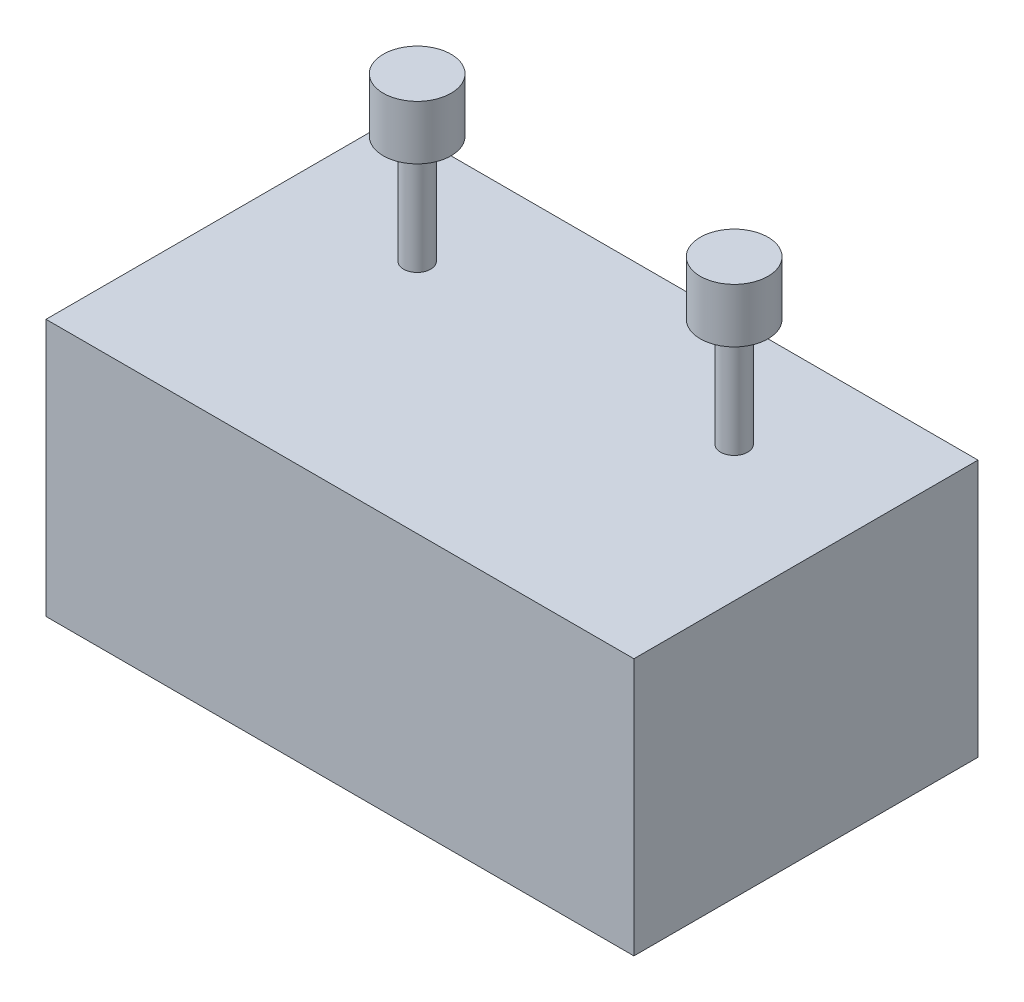
ISO-10303-21;
HEADER;
FILE_DESCRIPTION(('STEP AP214'),'2;1');
FILE_NAME('part.step','',(''),(''),'','','');
FILE_SCHEMA(('AUTOMOTIVE_DESIGN { 1 0 10303 214 1 1 1 1 }'));
ENDSEC;
DATA;
#1=APPLICATION_CONTEXT('core data for automotive mechanical design processes');
#2=APPLICATION_PROTOCOL_DEFINITION('international standard','automotive_design',2000,#1);
#3=PRODUCT_CONTEXT('',#1,'mechanical');
#4=PRODUCT('Part','Part','',(#3));
#5=PRODUCT_RELATED_PRODUCT_CATEGORY('part','',(#4));
#6=PRODUCT_DEFINITION_FORMATION('','',#4);
#7=PRODUCT_DEFINITION_CONTEXT('part definition',#1,'design');
#8=PRODUCT_DEFINITION('design','',#6,#7);
#9=PRODUCT_DEFINITION_SHAPE('','',#8);
#10=(LENGTH_UNIT() NAMED_UNIT(*) SI_UNIT(.MILLI.,.METRE.));
#11=(NAMED_UNIT(*) PLANE_ANGLE_UNIT() SI_UNIT($,.RADIAN.));
#12=(NAMED_UNIT(*) SI_UNIT($,.STERADIAN.) SOLID_ANGLE_UNIT());
#13=UNCERTAINTY_MEASURE_WITH_UNIT(LENGTH_MEASURE(1.E-05),#10,'distance_accuracy_value','');
#14=(GEOMETRIC_REPRESENTATION_CONTEXT(3) GLOBAL_UNCERTAINTY_ASSIGNED_CONTEXT((#13)) GLOBAL_UNIT_ASSIGNED_CONTEXT((#10,
#11,#12)) REPRESENTATION_CONTEXT('',''));
#15=CARTESIAN_POINT('',(0.,0.,0.));
#16=DIRECTION('',(0.,0.,1.));
#17=DIRECTION('',(1.,0.,0.));
#18=AXIS2_PLACEMENT_3D('',#15,#16,#17);
#19=CARTESIAN_POINT('',(108.5,95.,63.5));
#20=DIRECTION('',(-1.,0.,0.));
#21=DIRECTION('',(0.,0.,1.));
#22=AXIS2_PLACEMENT_3D('',#19,#20,#21);
#23=PLANE('',#22);
#24=DIRECTION('',(0.,0.,-1.));
#25=VECTOR('',#24,1.);
#26=CARTESIAN_POINT('',(108.5,0.,63.5));
#27=LINE('',#26,#25);
#28=CARTESIAN_POINT('',(108.5,0.,63.5));
#29=VERTEX_POINT('',#28);
#30=CARTESIAN_POINT('',(108.5,0.,-63.5));
#31=VERTEX_POINT('',#30);
#32=EDGE_CURVE('E111',#29,#31,#27,.T.);
#33=ORIENTED_EDGE('',*,*,#32,.T.);
#34=DIRECTION('',(0.,-1.,0.));
#35=VECTOR('',#34,1.);
#36=CARTESIAN_POINT('',(108.5,95.,-63.5));
#37=LINE('',#36,#35);
#38=CARTESIAN_POINT('',(108.5,95.,-63.5));
#39=VERTEX_POINT('',#38);
#40=EDGE_CURVE('E99',#39,#31,#37,.T.);
#41=ORIENTED_EDGE('',*,*,#40,.F.);
#42=DIRECTION('',(0.,0.,-1.));
#43=VECTOR('',#42,1.);
#44=CARTESIAN_POINT('',(108.5,95.,63.5));
#45=LINE('',#44,#43);
#46=CARTESIAN_POINT('',(108.5,95.,63.5));
#47=VERTEX_POINT('',#46);
#48=EDGE_CURVE('E91',#47,#39,#45,.T.);
#49=ORIENTED_EDGE('',*,*,#48,.F.);
#50=DIRECTION('',(0.,-1.,0.));
#51=VECTOR('',#50,1.);
#52=CARTESIAN_POINT('',(108.5,95.,63.5));
#53=LINE('',#52,#51);
#54=EDGE_CURVE('E107',#47,#29,#53,.T.);
#55=ORIENTED_EDGE('',*,*,#54,.T.);
#56=EDGE_LOOP('',(#33,#41,#49,#55));
#57=FACE_BOUND('',#56,.T.);
#58=ADVANCED_FACE('F38',(#57),#23,.F.);
#59=CARTESIAN_POINT('',(-108.5,95.,-63.5));
#60=DIRECTION('',(0.,0.,1.));
#61=DIRECTION('',(1.,0.,0.));
#62=AXIS2_PLACEMENT_3D('',#59,#60,#61);
#63=PLANE('',#62);
#64=DIRECTION('',(-1.,0.,0.));
#65=VECTOR('',#64,1.);
#66=CARTESIAN_POINT('',(-108.5,0.,-63.5));
#67=LINE('',#66,#65);
#68=CARTESIAN_POINT('',(-108.5,0.,-63.5));
#69=VERTEX_POINT('',#68);
#70=EDGE_CURVE('E97',#31,#69,#67,.T.);
#71=ORIENTED_EDGE('',*,*,#70,.T.);
#72=DIRECTION('',(0.,-1.,0.));
#73=VECTOR('',#72,1.);
#74=CARTESIAN_POINT('',(-108.5,95.,-63.5));
#75=LINE('',#74,#73);
#76=CARTESIAN_POINT('',(-108.5,95.,-63.5));
#77=VERTEX_POINT('',#76);
#78=EDGE_CURVE('E95',#77,#69,#75,.T.);
#79=ORIENTED_EDGE('',*,*,#78,.F.);
#80=DIRECTION('',(-1.,0.,0.));
#81=VECTOR('',#80,1.);
#82=CARTESIAN_POINT('',(-108.5,95.,-63.5));
#83=LINE('',#82,#81);
#84=EDGE_CURVE('E86',#39,#77,#83,.T.);
#85=ORIENTED_EDGE('',*,*,#84,.F.);
#86=ORIENTED_EDGE('',*,*,#40,.T.);
#87=EDGE_LOOP('',(#71,#79,#85,#86));
#88=FACE_BOUND('',#87,.T.);
#89=ADVANCED_FACE('F96',(#88),#63,.F.);
#90=CARTESIAN_POINT('',(-108.5,95.,63.5));
#91=DIRECTION('',(1.,0.,0.));
#92=DIRECTION('',(0.,0.,-1.));
#93=AXIS2_PLACEMENT_3D('',#90,#91,#92);
#94=PLANE('',#93);
#95=DIRECTION('',(0.,0.,1.));
#96=VECTOR('',#95,1.);
#97=CARTESIAN_POINT('',(-108.5,0.,63.5));
#98=LINE('',#97,#96);
#99=CARTESIAN_POINT('',(-108.5,0.,63.5));
#100=VERTEX_POINT('',#99);
#101=EDGE_CURVE('E72',#69,#100,#98,.T.);
#102=ORIENTED_EDGE('',*,*,#101,.T.);
#103=DIRECTION('',(0.,-1.,0.));
#104=VECTOR('',#103,1.);
#105=CARTESIAN_POINT('',(-108.5,95.,63.5));
#106=LINE('',#105,#104);
#107=CARTESIAN_POINT('',(-108.5,95.,63.5));
#108=VERTEX_POINT('',#107);
#109=EDGE_CURVE('E100',#108,#100,#106,.T.);
#110=ORIENTED_EDGE('',*,*,#109,.F.);
#111=DIRECTION('',(0.,0.,1.));
#112=VECTOR('',#111,1.);
#113=CARTESIAN_POINT('',(-108.5,95.,63.5));
#114=LINE('',#113,#112);
#115=EDGE_CURVE('E89',#77,#108,#114,.T.);
#116=ORIENTED_EDGE('',*,*,#115,.F.);
#117=ORIENTED_EDGE('',*,*,#78,.T.);
#118=EDGE_LOOP('',(#102,#110,#116,#117));
#119=FACE_BOUND('',#118,.T.);
#120=ADVANCED_FACE('F102',(#119),#94,.F.);
#121=CARTESIAN_POINT('',(-108.5,95.,63.5));
#122=DIRECTION('',(0.,0.,-1.));
#123=DIRECTION('',(-1.,0.,0.));
#124=AXIS2_PLACEMENT_3D('',#121,#122,#123);
#125=PLANE('',#124);
#126=DIRECTION('',(1.,0.,0.));
#127=VECTOR('',#126,1.);
#128=CARTESIAN_POINT('',(-108.5,0.,63.5));
#129=LINE('',#128,#127);
#130=EDGE_CURVE('E78',#100,#29,#129,.T.);
#131=ORIENTED_EDGE('',*,*,#130,.T.);
#132=ORIENTED_EDGE('',*,*,#54,.F.);
#133=DIRECTION('',(1.,0.,0.));
#134=VECTOR('',#133,1.);
#135=CARTESIAN_POINT('',(-108.5,95.,63.5));
#136=LINE('',#135,#134);
#137=EDGE_CURVE('E55',#108,#47,#136,.T.);
#138=ORIENTED_EDGE('',*,*,#137,.F.);
#139=ORIENTED_EDGE('',*,*,#109,.T.);
#140=EDGE_LOOP('',(#131,#132,#138,#139));
#141=FACE_BOUND('',#140,.T.);
#142=ADVANCED_FACE('F136',(#141),#125,.F.);
#143=CARTESIAN_POINT('',(0.,95.,0.));
#144=DIRECTION('',(0.,-1.,0.));
#145=DIRECTION('',(0.,0.,-1.));
#146=AXIS2_PLACEMENT_3D('',#143,#144,#145);
#147=PLANE('',#146);
#148=CARTESIAN_POINT('',(58.5,95.,-23.5));
#149=DIRECTION('',(0.,-1.,0.));
#150=DIRECTION('',(0.,0.,-1.));
#151=AXIS2_PLACEMENT_3D('',#148,#149,#150);
#152=CIRCLE('',#151,4.99999999999999);
#153=CARTESIAN_POINT('',(58.5,95.,-28.5));
#154=VERTEX_POINT('',#153);
#155=EDGE_CURVE('E11',#154,#154,#152,.F.);
#156=ORIENTED_EDGE('',*,*,#155,.F.);
#157=EDGE_LOOP('',(#156));
#158=FACE_BOUND('',#157,.T.);
#159=CARTESIAN_POINT('',(-58.5,95.,-23.5));
#160=DIRECTION('',(0.,-1.,0.));
#161=DIRECTION('',(0.,0.,-1.));
#162=AXIS2_PLACEMENT_3D('',#159,#160,#161);
#163=CIRCLE('',#162,5.);
#164=CARTESIAN_POINT('',(-58.5,95.,-28.5));
#165=VERTEX_POINT('',#164);
#166=EDGE_CURVE('E47',#165,#165,#163,.F.);
#167=ORIENTED_EDGE('',*,*,#166,.F.);
#168=EDGE_LOOP('',(#167));
#169=FACE_BOUND('',#168,.T.);
#170=ORIENTED_EDGE('',*,*,#48,.T.);
#171=ORIENTED_EDGE('',*,*,#84,.T.);
#172=ORIENTED_EDGE('',*,*,#115,.T.);
#173=ORIENTED_EDGE('',*,*,#137,.T.);
#174=EDGE_LOOP('',(#170,#171,#172,#173));
#175=FACE_BOUND('',#174,.T.);
#176=ADVANCED_FACE('F87',(#158,#169,#175),#147,.F.);
#177=CARTESIAN_POINT('',(0.,0.,0.));
#178=DIRECTION('',(0.,-1.,0.));
#179=DIRECTION('',(0.,0.,-1.));
#180=AXIS2_PLACEMENT_3D('',#177,#178,#179);
#181=PLANE('',#180);
#182=ORIENTED_EDGE('',*,*,#32,.F.);
#183=ORIENTED_EDGE('',*,*,#130,.F.);
#184=ORIENTED_EDGE('',*,*,#101,.F.);
#185=ORIENTED_EDGE('',*,*,#70,.F.);
#186=EDGE_LOOP('',(#182,#183,#184,#185));
#187=FACE_BOUND('',#186,.T.);
#188=ADVANCED_FACE('F135',(#187),#181,.T.);
#189=CARTESIAN_POINT('',(-58.5,135.,-23.5));
#190=DIRECTION('',(0.,-1.,0.));
#191=DIRECTION('',(0.,0.,-1.));
#192=AXIS2_PLACEMENT_3D('',#189,#190,#191);
#193=CYLINDRICAL_SURFACE('',#192,5.);
#194=CARTESIAN_POINT('',(-58.5,135.,-23.5));
#195=DIRECTION('',(0.,1.,0.));
#196=DIRECTION('',(0.,0.,1.));
#197=AXIS2_PLACEMENT_3D('',#194,#195,#196);
#198=CIRCLE('',#197,5.);
#199=CARTESIAN_POINT('',(-58.5,135.,-18.5));
#200=VERTEX_POINT('',#199);
#201=EDGE_CURVE('E115',#200,#200,#198,.T.);
#202=ORIENTED_EDGE('',*,*,#201,.F.);
#203=EDGE_LOOP('',(#202));
#204=FACE_BOUND('',#203,.T.);
#205=ORIENTED_EDGE('',*,*,#166,.T.);
#206=EDGE_LOOP('',(#205));
#207=FACE_BOUND('',#206,.T.);
#208=ADVANCED_FACE('F132',(#204,#207),#193,.T.);
#209=CARTESIAN_POINT('',(58.5,135.,-23.5));
#210=DIRECTION('',(0.,-1.,0.));
#211=DIRECTION('',(0.,0.,-1.));
#212=AXIS2_PLACEMENT_3D('',#209,#210,#211);
#213=CYLINDRICAL_SURFACE('',#212,4.99999999999999);
#214=CARTESIAN_POINT('',(58.5,135.,-23.5));
#215=DIRECTION('',(0.,1.,0.));
#216=DIRECTION('',(0.,0.,-1.));
#217=AXIS2_PLACEMENT_3D('',#214,#215,#216);
#218=CIRCLE('',#217,4.99999999999999);
#219=CARTESIAN_POINT('',(58.5,135.,-28.5));
#220=VERTEX_POINT('',#219);
#221=EDGE_CURVE('E160',#220,#220,#218,.T.);
#222=ORIENTED_EDGE('',*,*,#221,.F.);
#223=EDGE_LOOP('',(#222));
#224=FACE_BOUND('',#223,.T.);
#225=ORIENTED_EDGE('',*,*,#155,.T.);
#226=EDGE_LOOP('',(#225));
#227=FACE_BOUND('',#226,.T.);
#228=ADVANCED_FACE('F210',(#224,#227),#213,.T.);
#229=CARTESIAN_POINT('',(-58.5,155.,-23.5));
#230=DIRECTION('',(0.,-1.,0.));
#231=DIRECTION('',(0.,0.,-1.));
#232=AXIS2_PLACEMENT_3D('',#229,#230,#231);
#233=CYLINDRICAL_SURFACE('',#232,12.5);
#234=CARTESIAN_POINT('',(-58.5,155.,-23.5));
#235=DIRECTION('',(0.,1.,0.));
#236=DIRECTION('',(0.,0.,1.));
#237=AXIS2_PLACEMENT_3D('',#234,#235,#236);
#238=CIRCLE('',#237,12.5);
#239=CARTESIAN_POINT('',(-58.5,155.,-11.));
#240=VERTEX_POINT('',#239);
#241=EDGE_CURVE('E164',#240,#240,#238,.T.);
#242=ORIENTED_EDGE('',*,*,#241,.F.);
#243=EDGE_LOOP('',(#242));
#244=FACE_BOUND('',#243,.T.);
#245=CARTESIAN_POINT('',(-58.5,135.,-23.5));
#246=DIRECTION('',(0.,1.,0.));
#247=DIRECTION('',(0.,0.,1.));
#248=AXIS2_PLACEMENT_3D('',#245,#246,#247);
#249=CIRCLE('',#248,12.5);
#250=CARTESIAN_POINT('',(-58.5,135.,-11.));
#251=VERTEX_POINT('',#250);
#252=EDGE_CURVE('E165',#251,#251,#249,.T.);
#253=ORIENTED_EDGE('',*,*,#252,.T.);
#254=EDGE_LOOP('',(#253));
#255=FACE_BOUND('',#254,.T.);
#256=ADVANCED_FACE('F203',(#244,#255),#233,.T.);
#257=CARTESIAN_POINT('',(-58.5,155.,-23.5));
#258=DIRECTION('',(0.,1.,0.));
#259=DIRECTION('',(0.,0.,1.));
#260=AXIS2_PLACEMENT_3D('',#257,#258,#259);
#261=PLANE('',#260);
#262=ORIENTED_EDGE('',*,*,#241,.T.);
#263=EDGE_LOOP('',(#262));
#264=FACE_BOUND('',#263,.T.);
#265=ADVANCED_FACE('F200',(#264),#261,.T.);
#266=CARTESIAN_POINT('',(-58.5,135.,-23.5));
#267=DIRECTION('',(0.,1.,0.));
#268=DIRECTION('',(0.,0.,1.));
#269=AXIS2_PLACEMENT_3D('',#266,#267,#268);
#270=PLANE('',#269);
#271=ORIENTED_EDGE('',*,*,#201,.T.);
#272=EDGE_LOOP('',(#271));
#273=FACE_BOUND('',#272,.T.);
#274=ORIENTED_EDGE('',*,*,#252,.F.);
#275=EDGE_LOOP('',(#274));
#276=FACE_BOUND('',#275,.T.);
#277=ADVANCED_FACE('F187',(#273,#276),#270,.F.);
#278=CARTESIAN_POINT('',(58.5,155.,-23.5));
#279=DIRECTION('',(0.,-1.,0.));
#280=DIRECTION('',(0.,0.,-1.));
#281=AXIS2_PLACEMENT_3D('',#278,#279,#280);
#282=CYLINDRICAL_SURFACE('',#281,12.5);
#283=CARTESIAN_POINT('',(58.5,155.,-23.5));
#284=DIRECTION('',(0.,1.,0.));
#285=DIRECTION('',(0.,0.,1.));
#286=AXIS2_PLACEMENT_3D('',#283,#284,#285);
#287=CIRCLE('',#286,12.5);
#288=CARTESIAN_POINT('',(58.5,155.,-11.));
#289=VERTEX_POINT('',#288);
#290=EDGE_CURVE('E169',#289,#289,#287,.T.);
#291=ORIENTED_EDGE('',*,*,#290,.F.);
#292=EDGE_LOOP('',(#291));
#293=FACE_BOUND('',#292,.T.);
#294=CARTESIAN_POINT('',(58.5,135.,-23.5));
#295=DIRECTION('',(0.,1.,0.));
#296=DIRECTION('',(0.,0.,1.));
#297=AXIS2_PLACEMENT_3D('',#294,#295,#296);
#298=CIRCLE('',#297,12.5);
#299=CARTESIAN_POINT('',(58.5,135.,-11.));
#300=VERTEX_POINT('',#299);
#301=EDGE_CURVE('E173',#300,#300,#298,.T.);
#302=ORIENTED_EDGE('',*,*,#301,.T.);
#303=EDGE_LOOP('',(#302));
#304=FACE_BOUND('',#303,.T.);
#305=ADVANCED_FACE('F184',(#293,#304),#282,.T.);
#306=CARTESIAN_POINT('',(58.5,155.,-23.5));
#307=DIRECTION('',(0.,1.,0.));
#308=DIRECTION('',(0.,0.,1.));
#309=AXIS2_PLACEMENT_3D('',#306,#307,#308);
#310=PLANE('',#309);
#311=ORIENTED_EDGE('',*,*,#290,.T.);
#312=EDGE_LOOP('',(#311));
#313=FACE_BOUND('',#312,.T.);
#314=ADVANCED_FACE('F182',(#313),#310,.T.);
#315=CARTESIAN_POINT('',(58.5,135.,-23.5));
#316=DIRECTION('',(0.,1.,0.));
#317=DIRECTION('',(0.,0.,1.));
#318=AXIS2_PLACEMENT_3D('',#315,#316,#317);
#319=PLANE('',#318);
#320=ORIENTED_EDGE('',*,*,#221,.T.);
#321=EDGE_LOOP('',(#320));
#322=FACE_BOUND('',#321,.T.);
#323=ORIENTED_EDGE('',*,*,#301,.F.);
#324=EDGE_LOOP('',(#323));
#325=FACE_BOUND('',#324,.T.);
#326=ADVANCED_FACE('F191',(#322,#325),#319,.F.);
#327=CLOSED_SHELL('',(#58,#89,#120,#142,#176,#188,#208,#228,#256,#265,#277,#305,#314,#326));
#328=MANIFOLD_SOLID_BREP('B2',#327);
#329=ADVANCED_BREP_SHAPE_REPRESENTATION('',(#18,#328),#14);
#330=SHAPE_DEFINITION_REPRESENTATION(#9,#329);
ENDSEC;
END-ISO-10303-21;
